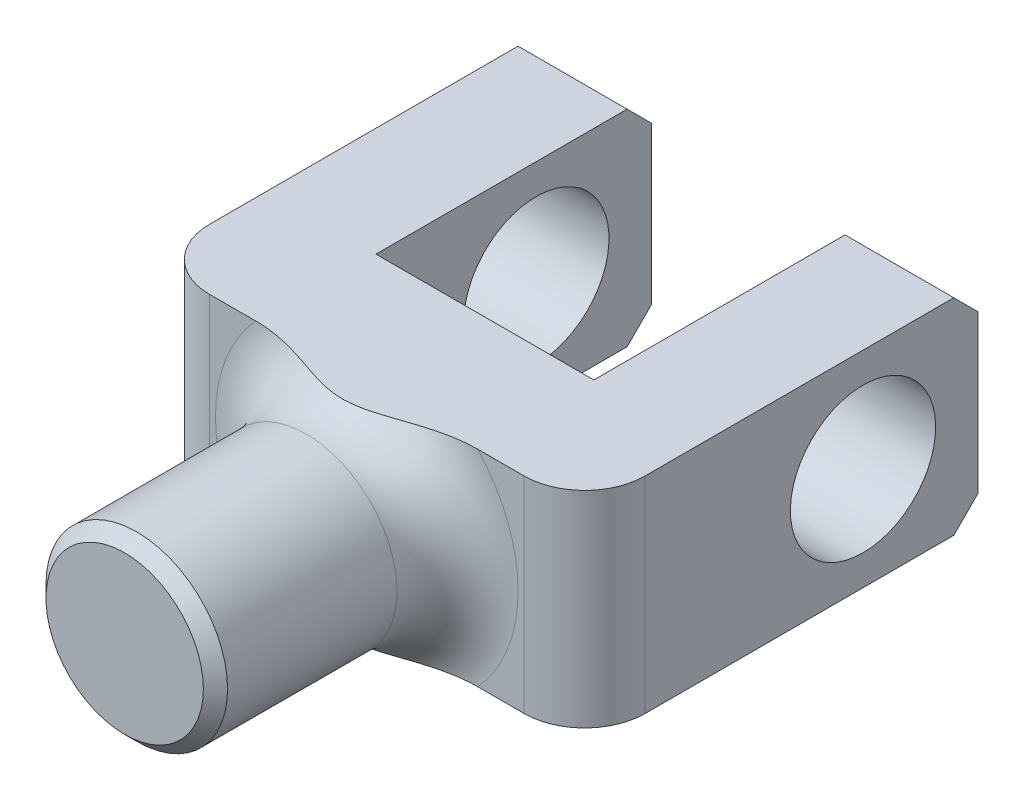
ISO-10303-21;
HEADER;
FILE_DESCRIPTION(('STEP AP214'),'2;1');
FILE_NAME('part.step','',(''),(''),'','','');
FILE_SCHEMA(('AUTOMOTIVE_DESIGN { 1 0 10303 214 1 1 1 1 }'));
ENDSEC;
DATA;
#1=APPLICATION_CONTEXT('core data for automotive mechanical design processes');
#2=APPLICATION_PROTOCOL_DEFINITION('international standard','automotive_design',2000,#1);
#3=PRODUCT_CONTEXT('',#1,'mechanical');
#4=PRODUCT('Part','Part','',(#3));
#5=PRODUCT_RELATED_PRODUCT_CATEGORY('part','',(#4));
#6=PRODUCT_DEFINITION_FORMATION('','',#4);
#7=PRODUCT_DEFINITION_CONTEXT('part definition',#1,'design');
#8=PRODUCT_DEFINITION('design','',#6,#7);
#9=PRODUCT_DEFINITION_SHAPE('','',#8);
#10=(LENGTH_UNIT() NAMED_UNIT(*) SI_UNIT(.MILLI.,.METRE.));
#11=(NAMED_UNIT(*) PLANE_ANGLE_UNIT() SI_UNIT($,.RADIAN.));
#12=(NAMED_UNIT(*) SI_UNIT($,.STERADIAN.) SOLID_ANGLE_UNIT());
#13=UNCERTAINTY_MEASURE_WITH_UNIT(LENGTH_MEASURE(1.E-05),#10,'distance_accuracy_value','');
#14=(GEOMETRIC_REPRESENTATION_CONTEXT(3) GLOBAL_UNCERTAINTY_ASSIGNED_CONTEXT((#13)) GLOBAL_UNIT_ASSIGNED_CONTEXT((#10,
#11,#12)) REPRESENTATION_CONTEXT('',''));
#15=CARTESIAN_POINT('',(0.,0.,0.));
#16=DIRECTION('',(0.,0.,1.));
#17=DIRECTION('',(1.,0.,0.));
#18=AXIS2_PLACEMENT_3D('',#15,#16,#17);
#19=CARTESIAN_POINT('',(17.2291220556745,40.3158458244111,55.));
#20=DIRECTION('',(0.,-1.,0.));
#21=DIRECTION('',(1.,0.,0.));
#22=AXIS2_PLACEMENT_3D('',#19,#20,#21);
#23=CYLINDRICAL_SURFACE('',#22,10.);
#24=DIRECTION('',(0.,-1.,0.));
#25=VECTOR('',#24,1.);
#26=CARTESIAN_POINT('',(27.2291220556745,40.3158458244111,55.));
#27=LINE('',#26,#25);
#28=CARTESIAN_POINT('',(27.2291220556745,40.3158458244111,55.));
#29=VERTEX_POINT('',#28);
#30=CARTESIAN_POINT('',(27.2291220556745,6.31584582441112,55.));
#31=VERTEX_POINT('',#30);
#32=EDGE_CURVE('E432',#29,#31,#27,.T.);
#33=ORIENTED_EDGE('',*,*,#32,.F.);
#34=CARTESIAN_POINT('',(17.2291220556745,40.3158458244111,55.));
#35=DIRECTION('',(0.,-1.,0.));
#36=DIRECTION('',(0.,0.,-1.));
#37=AXIS2_PLACEMENT_3D('',#34,#35,#36);
#38=CIRCLE('',#37,10.);
#39=CARTESIAN_POINT('',(17.2291220556745,40.3158458244111,65.));
#40=VERTEX_POINT('',#39);
#41=EDGE_CURVE('E529',#40,#29,#38,.F.);
#42=ORIENTED_EDGE('',*,*,#41,.F.);
#43=DIRECTION('',(0.,-1.,0.));
#44=VECTOR('',#43,1.);
#45=CARTESIAN_POINT('',(17.2291220556745,0.,65.));
#46=LINE('',#45,#44);
#47=CARTESIAN_POINT('',(17.2291220556745,6.31584582441112,65.));
#48=VERTEX_POINT('',#47);
#49=EDGE_CURVE('E504',#48,#40,#46,.F.);
#50=ORIENTED_EDGE('',*,*,#49,.F.);
#51=CARTESIAN_POINT('',(17.2291220556745,6.31584582441112,55.));
#52=DIRECTION('',(0.,1.,0.));
#53=DIRECTION('',(-1.,0.,0.));
#54=AXIS2_PLACEMENT_3D('',#51,#52,#53);
#55=CIRCLE('',#54,10.);
#56=EDGE_CURVE('E435',#31,#48,#55,.F.);
#57=ORIENTED_EDGE('',*,*,#56,.F.);
#58=EDGE_LOOP('',(#33,#42,#50,#57));
#59=FACE_BOUND('',#58,.T.);
#60=ADVANCED_FACE('F84',(#59),#23,.T.);
#61=CARTESIAN_POINT('',(-34.7708779443255,6.31584582441111,55.));
#62=DIRECTION('',(0.,1.,0.));
#63=DIRECTION('',(0.,0.,1.));
#64=AXIS2_PLACEMENT_3D('',#61,#62,#63);
#65=CYLINDRICAL_SURFACE('',#64,10.);
#66=DIRECTION('',(0.,1.,0.));
#67=VECTOR('',#66,1.);
#68=CARTESIAN_POINT('',(-44.7708779443255,6.31584582441111,55.));
#69=LINE('',#68,#67);
#70=CARTESIAN_POINT('',(-44.7708779443255,6.31584582441111,55.));
#71=VERTEX_POINT('',#70);
#72=CARTESIAN_POINT('',(-44.7708779443255,40.3158458244111,55.));
#73=VERTEX_POINT('',#72);
#74=EDGE_CURVE('E509',#71,#73,#69,.T.);
#75=ORIENTED_EDGE('',*,*,#74,.F.);
#76=CARTESIAN_POINT('',(-34.7708779443255,6.31584582441111,55.));
#77=DIRECTION('',(0.,1.,0.));
#78=DIRECTION('',(-1.,0.,0.));
#79=AXIS2_PLACEMENT_3D('',#76,#77,#78);
#80=CIRCLE('',#79,10.);
#81=CARTESIAN_POINT('',(-34.7708779443255,6.31584582441111,65.));
#82=VERTEX_POINT('',#81);
#83=EDGE_CURVE('E517',#82,#71,#80,.F.);
#84=ORIENTED_EDGE('',*,*,#83,.F.);
#85=DIRECTION('',(0.,1.,0.));
#86=VECTOR('',#85,1.);
#87=CARTESIAN_POINT('',(-34.7708779443255,0.,65.));
#88=LINE('',#87,#86);
#89=CARTESIAN_POINT('',(-34.7708779443255,40.3158458244111,65.));
#90=VERTEX_POINT('',#89);
#91=EDGE_CURVE('E490',#90,#82,#88,.F.);
#92=ORIENTED_EDGE('',*,*,#91,.F.);
#93=CARTESIAN_POINT('',(-34.7708779443255,40.3158458244111,55.));
#94=DIRECTION('',(0.,-1.,0.));
#95=DIRECTION('',(0.,0.,-1.));
#96=AXIS2_PLACEMENT_3D('',#93,#94,#95);
#97=CIRCLE('',#96,10.);
#98=EDGE_CURVE('E522',#73,#90,#97,.F.);
#99=ORIENTED_EDGE('',*,*,#98,.F.);
#100=EDGE_LOOP('',(#75,#84,#92,#99));
#101=FACE_BOUND('',#100,.T.);
#102=ADVANCED_FACE('F315',(#101),#65,.T.);
#103=CARTESIAN_POINT('',(-8.77087794432547,23.3158458244111,75.));
#104=DIRECTION('',(0.,0.,-1.));
#105=DIRECTION('',(-1.,0.,0.));
#106=AXIS2_PLACEMENT_3D('',#103,#104,#105);
#107=TOROIDAL_SURFACE('',#106,25.,10.);
#108=CARTESIAN_POINT('',(-8.77087794432547,23.3158458244111,75.));
#109=DIRECTION('',(0.,0.,-1.));
#110=DIRECTION('',(-1.,0.,0.));
#111=AXIS2_PLACEMENT_3D('',#108,#109,#110);
#112=CIRCLE('',#111,15.);
#113=CARTESIAN_POINT('',(-23.7708779443255,23.3158458244111,75.));
#114=VERTEX_POINT('',#113);
#115=EDGE_CURVE('E271',#114,#114,#112,.F.);
#116=ORIENTED_EDGE('',*,*,#115,.F.);
#117=EDGE_LOOP('',(#116));
#118=FACE_BOUND('',#117,.T.);
#119=CARTESIAN_POINT('',(-27.1011807241488,40.3158458244111,65.));
#120=CARTESIAN_POINT('',(-26.7822287961629,40.3158458244111,64.9999999765905));
#121=CARTESIAN_POINT('',(-26.4633667016794,40.3158458244111,65.0082034472168));
#122=CARTESIAN_POINT('',(-25.8265308566789,40.3158458244111,65.0397990120687));
#123=CARTESIAN_POINT('',(-25.5085567700214,40.3158458244111,65.0631842455926));
#124=CARTESIAN_POINT('',(-24.5575387074593,40.3158458244111,65.1542084302681));
#125=CARTESIAN_POINT('',(-23.9264488646185,40.3158458244111,65.2427231329521));
#126=CARTESIAN_POINT('',(-22.6558912875072,40.3158458244111,65.4684215154835));
#127=CARTESIAN_POINT('',(-22.0166535454229,40.3158458244111,65.6068480964166));
#128=CARTESIAN_POINT('',(-20.7478282199285,40.3158458244111,65.920583970391));
#129=CARTESIAN_POINT('',(-20.1182360830403,40.3158458244111,66.0958752463392));
#130=CARTESIAN_POINT('',(-19.0037420474493,40.3158458244111,66.4301776550955));
#131=CARTESIAN_POINT('',(-18.5173499328625,40.3158458244111,66.5843464969013));
#132=CARTESIAN_POINT('',(-17.5474011933552,40.3158458244111,66.9013666284473));
#133=CARTESIAN_POINT('',(-17.0638447522287,40.3158458244111,67.0642184742207));
#134=CARTESIAN_POINT('',(-16.3378745445991,40.3158458244111,67.3095309996821));
#135=CARTESIAN_POINT('',(-16.0953320539569,40.3158458244111,67.3916261892551));
#136=CARTESIAN_POINT('',(-15.6099405230153,40.3158458244111,67.5549028881324));
#137=CARTESIAN_POINT('',(-15.3670914849674,40.3158458244111,67.6360844041048));
#138=CARTESIAN_POINT('',(-14.8806067047279,40.3158458244111,67.7962803323809));
#139=CARTESIAN_POINT('',(-14.636970790428,40.3158458244111,67.8752942288198));
#140=CARTESIAN_POINT('',(-14.1485477742455,40.3158458244111,68.0296679522297));
#141=CARTESIAN_POINT('',(-13.9037606414176,40.3158458244111,68.1050276803521));
#142=CARTESIAN_POINT('',(-13.1852370481622,40.3158458244111,68.3178031351));
#143=CARTESIAN_POINT('',(-12.7092781897232,40.3158458244111,68.4481030803418));
#144=CARTESIAN_POINT('',(-11.9894462032609,40.3158458244111,68.6186374019243));
#145=CARTESIAN_POINT('',(-11.7485399169853,40.3158458244111,68.6713262777047));
#146=CARTESIAN_POINT('',(-11.2647447923755,40.3158458244111,68.7665526365442));
#147=CARTESIAN_POINT('',(-11.0218563069375,40.3158458244111,68.8090918874809));
#148=CARTESIAN_POINT('',(-10.5363371576699,40.3158458244111,68.8819996020455));
#149=CARTESIAN_POINT('',(-10.2937216955109,40.3158458244111,68.9124679827324));
#150=CARTESIAN_POINT('',(-9.80719160021027,40.3158458244111,68.9603553349178));
#151=CARTESIAN_POINT('',(-9.56327699745105,40.3158458244111,68.977774610253));
#152=CARTESIAN_POINT('',(-9.07492989013347,40.3158458244111,68.9986949593541));
#153=CARTESIAN_POINT('',(-8.83049759918579,40.3158458244111,69.0022009520805));
#154=CARTESIAN_POINT('',(-8.34184425846334,40.3158458244111,68.9951237729492));
#155=CARTESIAN_POINT('',(-8.09762320109899,40.3158458244111,68.9845411302914));
#156=CARTESIAN_POINT('',(-7.66812849755424,40.3158458244111,68.9539647377072));
#157=CARTESIAN_POINT('',(-7.48264549742014,40.3158458244111,68.9368068607216));
#158=CARTESIAN_POINT('',(-7.11250328185269,40.3158458244111,68.8951204203172));
#159=CARTESIAN_POINT('',(-6.92784412940252,40.3158458244111,68.8705913028439));
#160=CARTESIAN_POINT('',(-6.37538185946503,40.3158458244111,68.7868680805503));
#161=CARTESIAN_POINT('',(-6.00909983752891,40.3158458244111,68.7175385626282));
#162=CARTESIAN_POINT('',(-5.27880213078365,40.3158458244111,68.5574228912256));
#163=CARTESIAN_POINT('',(-4.91481903859819,40.3158458244111,68.4664933472288));
#164=CARTESIAN_POINT('',(-4.19098366700157,40.3158458244111,68.2697732936779));
#165=CARTESIAN_POINT('',(-3.83113120095126,40.3158458244111,68.1639834584566));
#166=CARTESIAN_POINT('',(-3.1005146799794,40.3158458244111,67.9388662388692));
#167=CARTESIAN_POINT('',(-2.72986499800355,40.3158458244111,67.8191741207872));
#168=CARTESIAN_POINT('',(-1.99016692628789,40.3158458244111,67.5750191991421));
#169=CARTESIAN_POINT('',(-1.6211185203701,40.3158458244111,67.4505564439033));
#170=CARTESIAN_POINT('',(-0.884084185797127,40.3158458244111,67.2014846963883));
#171=CARTESIAN_POINT('',(-0.51609787711605,40.3158458244111,67.0768768173913));
#172=CARTESIAN_POINT('',(0.220934020641621,40.3158458244111,66.8308158211743));
#173=CARTESIAN_POINT('',(0.589979597313518,40.3158458244111,66.7093626671765));
#174=CARTESIAN_POINT('',(1.32478072251782,40.3158458244111,66.4744265591823));
#175=CARTESIAN_POINT('',(1.69050743834978,40.3158458244111,66.3608542121729));
#176=CARTESIAN_POINT('',(2.42458609011452,40.3158458244111,66.1424755010138));
#177=CARTESIAN_POINT('',(2.7929379980023,40.3158458244111,66.03766904337));
#178=CARTESIAN_POINT('',(3.53255947272921,40.3158458244111,65.8393205259961));
#179=CARTESIAN_POINT('',(3.9038280591552,40.3158458244111,65.7457748402921));
#180=CARTESIAN_POINT('',(4.64951525500419,40.3158458244111,65.5722507206898));
#181=CARTESIAN_POINT('',(5.02393357696605,40.3158458244111,65.4922710624875));
#182=CARTESIAN_POINT('',(5.76633613682528,40.3158458244111,65.3499422570415));
#183=CARTESIAN_POINT('',(6.13424409400565,40.3158458244111,65.2871989028186));
#184=CARTESIAN_POINT('',(6.87252086897315,40.3158458244111,65.1787826179311));
#185=CARTESIAN_POINT('',(7.24288920139515,40.3158458244111,65.1331064165304));
#186=CARTESIAN_POINT('',(7.98703655630066,40.3158458244111,65.0606675596706));
#187=CARTESIAN_POINT('',(8.36082332126401,40.3158458244111,65.0339824500208));
#188=CARTESIAN_POINT('',(9.10956437163241,40.3158458244111,65.0017978339897));
#189=CARTESIAN_POINT('',(9.48451931250049,40.3158458244111,64.9963138882017));
#190=CARTESIAN_POINT('',(9.85940741253844,40.3158458244111,65.0024373949675));
#191=B_SPLINE_CURVE_WITH_KNOTS('',3,(#119,#120,#121,#122,#123,#124,#125,#126,#127,#128,#129,
#130,#131,#132,#133,#134,#135,#136,#137,#138,#139,#140,#141,#142,#143,#144,#145,#146,#147,#148,
#149,#150,#151,#152,#153,#154,#155,#156,#157,#158,#159,#160,#161,#162,#163,#164,#165,#166,#167,
#168,#169,#170,#171,#172,#173,#174,#175,#176,#177,#178,#179,#180,#181,#182,#183,#184,#185,#186,
#187,#188,#189,#190),.UNSPECIFIED.,.F.,.F.,(4,2,2,2,2,2,2,2,2,2,2,2,2,2,2,2,2,2,2,2,2,2,2,2,2,2,
2,2,2,2,2,2,2,2,2,4),(0.,0.956605090842401,1.9127781885001,3.82228496738571,5.78305988530367,
7.74287872030254,9.27348111542979,10.804181643685,11.5723617102261,12.3405361667395,
13.1088918800318,13.8772683665142,15.3567694921308,16.0963987871005,16.8358991580744,
17.5691435625241,18.3023708935107,19.0353389731186,19.7682795216223,20.3269534247612,
20.8856693307733,22.0031188727751,23.1282047273474,24.2532395440749,25.4216602912566,
26.5900692060591,27.7556033156376,28.9211238313138,30.0699111783337,31.2186862711699,
32.3670904627329,33.5153909581393,34.6346944489816,35.7537833272141,36.8774159328818,
38.0018730722687),.UNSPECIFIED.);
#192=CARTESIAN_POINT('',(-27.1011807241488,40.3158458244111,65.));
#193=VERTEX_POINT('',#192);
#194=CARTESIAN_POINT('',(9.55942483549789,40.3158458244111,65.));
#195=VERTEX_POINT('',#194);
#196=EDGE_CURVE('E299',#193,#195,#191,.T.);
#197=ORIENTED_EDGE('',*,*,#196,.F.);
#198=CARTESIAN_POINT('',(-8.77087794432547,23.3158458244111,65.));
#199=DIRECTION('',(0.,0.,-1.));
#200=DIRECTION('',(-1.,0.,0.));
#201=AXIS2_PLACEMENT_3D('',#198,#199,#200);
#202=CIRCLE('',#201,25.);
#203=CARTESIAN_POINT('',(-27.1011807241488,6.31584582441111,65.));
#204=VERTEX_POINT('',#203);
#205=EDGE_CURVE('E285',#204,#193,#202,.T.);
#206=ORIENTED_EDGE('',*,*,#205,.F.);
#207=CARTESIAN_POINT('',(9.55942483549789,6.31584582441111,65.));
#208=CARTESIAN_POINT('',(9.24047290751195,6.31584582441111,64.9999999765905));
#209=CARTESIAN_POINT('',(8.92161081302844,6.31584582441111,65.0082034472168));
#210=CARTESIAN_POINT('',(8.28477496802793,6.31584582441111,65.0397990120687));
#211=CARTESIAN_POINT('',(7.96680088137042,6.31584582441111,65.0631842455926));
#212=CARTESIAN_POINT('',(7.01578281880838,6.31584582441111,65.1542084302681));
#213=CARTESIAN_POINT('',(6.38469297596753,6.31584582441111,65.2427231329521));
#214=CARTESIAN_POINT('',(5.11413539885623,6.31584582441111,65.4684215154835));
#215=CARTESIAN_POINT('',(4.47489765677197,6.31584582441111,65.6068480964166));
#216=CARTESIAN_POINT('',(3.20607233127749,6.31584582441111,65.920583970391));
#217=CARTESIAN_POINT('',(2.57648019438931,6.31584582441111,66.0958752463392));
#218=CARTESIAN_POINT('',(1.46198615879832,6.31584582441111,66.4301776550955));
#219=CARTESIAN_POINT('',(0.975594044211556,6.31584582441111,66.5843464969013));
#220=CARTESIAN_POINT('',(0.00564530470417913,6.31584582441111,66.9013666284473));
#221=CARTESIAN_POINT('',(-0.477911136422321,6.31584582441111,67.0642184742208));
#222=CARTESIAN_POINT('',(-1.20388134405188,6.31584582441111,67.3095309996821));
#223=CARTESIAN_POINT('',(-1.44642383469406,6.31584582441111,67.3916261892552));
#224=CARTESIAN_POINT('',(-1.93181536563572,6.31584582441111,67.5549028881324));
#225=CARTESIAN_POINT('',(-2.17466440368353,6.31584582441111,67.6360844041048));
#226=CARTESIAN_POINT('',(-2.6611491839231,6.31584582441111,67.796280332381));
#227=CARTESIAN_POINT('',(-2.90478509822298,6.31584582441111,67.8752942288198));
#228=CARTESIAN_POINT('',(-3.39320811440547,6.31584582441111,68.0296679522298));
#229=CARTESIAN_POINT('',(-3.63799524723338,6.31584582441111,68.1050276803521));
#230=CARTESIAN_POINT('',(-4.3565188404888,6.31584582441111,68.3178031351));
#231=CARTESIAN_POINT('',(-4.8324776989278,6.31584582441111,68.4481030803418));
#232=CARTESIAN_POINT('',(-5.55230968539006,6.31584582441111,68.6186374019243));
#233=CARTESIAN_POINT('',(-5.79321597166568,6.31584582441111,68.6713262777047));
#234=CARTESIAN_POINT('',(-6.27701109627549,6.31584582441111,68.7665526365442));
#235=CARTESIAN_POINT('',(-6.51989958171353,6.31584582441111,68.8090918874809));
#236=CARTESIAN_POINT('',(-7.00541873098107,6.31584582441111,68.8819996020455));
#237=CARTESIAN_POINT('',(-7.24803419314004,6.31584582441111,68.9124679827324));
#238=CARTESIAN_POINT('',(-7.73456428844072,6.31584582441111,68.9603553349178));
#239=CARTESIAN_POINT('',(-7.97847889119994,6.31584582441111,68.977774610253));
#240=CARTESIAN_POINT('',(-8.46682599851751,6.31584582441111,68.9986949593541));
#241=CARTESIAN_POINT('',(-8.7112582894652,6.31584582441111,69.0022009520805));
#242=CARTESIAN_POINT('',(-9.19991163018764,6.31584582441111,68.9951237729492));
#243=CARTESIAN_POINT('',(-9.444132687552,6.31584582441111,68.9845411302914));
#244=CARTESIAN_POINT('',(-9.87362739109675,6.31584582441111,68.9539647377072));
#245=CARTESIAN_POINT('',(-10.0591103912308,6.31584582441111,68.9368068607216));
#246=CARTESIAN_POINT('',(-10.4292526067983,6.31584582441111,68.8951204203172));
#247=CARTESIAN_POINT('',(-10.6139117592485,6.31584582441111,68.8705913028439));
#248=CARTESIAN_POINT('',(-11.166374029186,6.31584582441111,68.7868680805503));
#249=CARTESIAN_POINT('',(-11.5326560511221,6.31584582441111,68.7175385626282));
#250=CARTESIAN_POINT('',(-12.2629537578674,6.31584582441111,68.5574228912256));
#251=CARTESIAN_POINT('',(-12.6269368500528,6.31584582441111,68.4664933472287));
#252=CARTESIAN_POINT('',(-13.3507722216494,6.31584582441111,68.2697732936779));
#253=CARTESIAN_POINT('',(-13.7106246876998,6.31584582441111,68.1639834584566));
#254=CARTESIAN_POINT('',(-14.4412412086716,6.31584582441111,67.9388662388692));
#255=CARTESIAN_POINT('',(-14.8118908906475,6.31584582441111,67.8191741207871));
#256=CARTESIAN_POINT('',(-15.5515889623631,6.31584582441111,67.5750191991421));
#257=CARTESIAN_POINT('',(-15.9206373682809,6.31584582441111,67.4505564439032));
#258=CARTESIAN_POINT('',(-16.6576717028539,6.31584582441111,67.2014846963882));
#259=CARTESIAN_POINT('',(-17.025658011535,6.31584582441111,67.0768768173912));
#260=CARTESIAN_POINT('',(-17.7626899092927,6.31584582441111,66.8308158211742));
#261=CARTESIAN_POINT('',(-18.1317354859646,6.31584582441111,66.7093626671764));
#262=CARTESIAN_POINT('',(-18.8665366111689,6.31584582441111,66.4744265591823));
#263=CARTESIAN_POINT('',(-19.2322633270008,6.31584582441111,66.3608542121728));
#264=CARTESIAN_POINT('',(-19.9663419787656,6.31584582441111,66.1424755010138));
#265=CARTESIAN_POINT('',(-20.3346938866534,6.31584582441111,66.0376690433699));
#266=CARTESIAN_POINT('',(-21.0743153613803,6.31584582441111,65.8393205259961));
#267=CARTESIAN_POINT('',(-21.4455839478063,6.31584582441111,65.745774840292));
#268=CARTESIAN_POINT('',(-22.1912711436553,6.31584582441111,65.5722507206897));
#269=CARTESIAN_POINT('',(-22.5656894656171,6.31584582441111,65.4922710624874));
#270=CARTESIAN_POINT('',(-23.3080920254764,6.31584582441111,65.3499422570415));
#271=CARTESIAN_POINT('',(-23.6759999826567,6.31584582441111,65.2871989028185));
#272=CARTESIAN_POINT('',(-24.4142767576242,6.31584582441111,65.178782617931));
#273=CARTESIAN_POINT('',(-24.7846450900463,6.31584582441111,65.1331064165304));
#274=CARTESIAN_POINT('',(-25.5287924449518,6.31584582441111,65.0606675596706));
#275=CARTESIAN_POINT('',(-25.9025792099151,6.31584582441111,65.0339824500208));
#276=CARTESIAN_POINT('',(-26.6513202602835,6.31584582441111,65.0017978339897));
#277=CARTESIAN_POINT('',(-27.0262752011516,6.31584582441111,64.9963138882017));
#278=CARTESIAN_POINT('',(-27.4011633011896,6.31584582441111,65.0024373949675));
#279=B_SPLINE_CURVE_WITH_KNOTS('',3,(#207,#208,#209,#210,#211,#212,#213,#214,#215,#216,#217,
#218,#219,#220,#221,#222,#223,#224,#225,#226,#227,#228,#229,#230,#231,#232,#233,#234,#235,#236,
#237,#238,#239,#240,#241,#242,#243,#244,#245,#246,#247,#248,#249,#250,#251,#252,#253,#254,#255,
#256,#257,#258,#259,#260,#261,#262,#263,#264,#265,#266,#267,#268,#269,#270,#271,#272,#273,#274,
#275,#276,#277,#278),.UNSPECIFIED.,.F.,.F.,(4,2,2,2,2,2,2,2,2,2,2,2,2,2,2,2,2,2,2,2,2,2,2,2,2,2,
2,2,2,2,2,2,2,2,2,4),(0.,0.956605090842407,1.91277818850011,3.82228496738572,5.78305988530369,
7.74287872030257,9.27348111542982,10.8041816436851,11.5723617102261,12.3405361667395,
13.1088918800318,13.8772683665142,15.3567694921308,16.0963987871006,16.8358991580744,
17.5691435625241,18.3023708935108,19.0353389731186,19.7682795216224,20.3269534247613,
20.8856693307734,22.0031188727752,23.1282047273475,24.253239544075,25.4216602912567,
26.5900692060592,27.7556033156376,28.9211238313139,30.0699111783338,31.21868627117,
32.367090462733,33.5153909581395,34.6346944489818,35.7537833272143,36.877415932882,
38.0018730722689),.UNSPECIFIED.);
#280=CARTESIAN_POINT('',(9.55942483549789,6.31584582441112,65.));
#281=VERTEX_POINT('',#280);
#282=EDGE_CURVE('E289',#281,#204,#279,.T.);
#283=ORIENTED_EDGE('',*,*,#282,.F.);
#284=CARTESIAN_POINT('',(-8.77087794432547,23.3158458244111,65.));
#285=DIRECTION('',(0.,0.,-1.));
#286=DIRECTION('',(-1.,0.,0.));
#287=AXIS2_PLACEMENT_3D('',#284,#285,#286);
#288=CIRCLE('',#287,25.);
#289=EDGE_CURVE('E281',#195,#281,#288,.T.);
#290=ORIENTED_EDGE('',*,*,#289,.F.);
#291=EDGE_LOOP('',(#197,#206,#283,#290));
#292=FACE_BOUND('',#291,.T.);
#293=ADVANCED_FACE('F310',(#118,#292),#107,.F.);
#294=CARTESIAN_POINT('',(0.,0.,65.));
#295=DIRECTION('',(0.,0.,-1.));
#296=DIRECTION('',(-1.,0.,0.));
#297=AXIS2_PLACEMENT_3D('',#294,#295,#296);
#298=PLANE('',#297);
#299=DIRECTION('',(-1.,0.,0.));
#300=VECTOR('',#299,1.);
#301=CARTESIAN_POINT('',(-44.7708779443255,40.3158458244111,65.));
#302=LINE('',#301,#300);
#303=EDGE_CURVE('E244',#193,#90,#302,.T.);
#304=ORIENTED_EDGE('',*,*,#303,.T.);
#305=ORIENTED_EDGE('',*,*,#91,.T.);
#306=DIRECTION('',(1.,0.,0.));
#307=VECTOR('',#306,1.);
#308=CARTESIAN_POINT('',(27.2291220556745,6.31584582441112,65.));
#309=LINE('',#308,#307);
#310=EDGE_CURVE('E241',#82,#204,#309,.T.);
#311=ORIENTED_EDGE('',*,*,#310,.T.);
#312=ORIENTED_EDGE('',*,*,#205,.T.);
#313=EDGE_LOOP('',(#304,#305,#311,#312));
#314=FACE_BOUND('',#313,.T.);
#315=ADVANCED_FACE('F314',(#314),#298,.F.);
#316=CARTESIAN_POINT('',(0.,0.,0.));
#317=DIRECTION('',(0.,0.,-1.));
#318=DIRECTION('',(-1.,0.,0.));
#319=AXIS2_PLACEMENT_3D('',#316,#317,#318);
#320=PLANE('',#319);
#321=DIRECTION('',(0.,1.,0.));
#322=VECTOR('',#321,1.);
#323=CARTESIAN_POINT('',(-26.7445389275703,6.31584582441111,0.));
#324=LINE('',#323,#322);
#325=CARTESIAN_POINT('',(-26.7445389275703,10.3158458244111,0.));
#326=VERTEX_POINT('',#325);
#327=CARTESIAN_POINT('',(-26.7445389275703,36.3158458244111,0.));
#328=VERTEX_POINT('',#327);
#329=EDGE_CURVE('E224',#326,#328,#324,.T.);
#330=ORIENTED_EDGE('',*,*,#329,.F.);
#331=DIRECTION('',(-1.,0.,0.));
#332=VECTOR('',#331,1.);
#333=CARTESIAN_POINT('',(-44.7708779443255,10.3158458244111,0.));
#334=LINE('',#333,#332);
#335=CARTESIAN_POINT('',(-44.7708779443255,10.3158458244111,0.));
#336=VERTEX_POINT('',#335);
#337=EDGE_CURVE('E109',#326,#336,#334,.T.);
#338=ORIENTED_EDGE('',*,*,#337,.T.);
#339=DIRECTION('',(0.,-1.,0.));
#340=VECTOR('',#339,1.);
#341=CARTESIAN_POINT('',(-44.7708779443255,6.31584582441111,0.));
#342=LINE('',#341,#340);
#343=CARTESIAN_POINT('',(-44.7708779443255,36.3158458244111,0.));
#344=VERTEX_POINT('',#343);
#345=EDGE_CURVE('E250',#344,#336,#342,.T.);
#346=ORIENTED_EDGE('',*,*,#345,.F.);
#347=DIRECTION('',(1.,0.,0.));
#348=VECTOR('',#347,1.);
#349=CARTESIAN_POINT('',(-26.7445389275703,36.3158458244111,0.));
#350=LINE('',#349,#348);
#351=EDGE_CURVE('E358',#344,#328,#350,.T.);
#352=ORIENTED_EDGE('',*,*,#351,.T.);
#353=EDGE_LOOP('',(#330,#338,#346,#352));
#354=FACE_BOUND('',#353,.T.);
#355=ADVANCED_FACE('F412',(#354),#320,.T.);
#356=CARTESIAN_POINT('',(-44.7708779443255,6.31584582441111,65.));
#357=DIRECTION('',(1.,0.,0.));
#358=DIRECTION('',(0.,0.,-1.));
#359=AXIS2_PLACEMENT_3D('',#356,#357,#358);
#360=PLANE('',#359);
#361=CARTESIAN_POINT('',(-44.7708779443255,23.3158458244111,19.));
#362=DIRECTION('',(-1.,0.,0.));
#363=DIRECTION('',(0.,0.,1.));
#364=AXIS2_PLACEMENT_3D('',#361,#362,#363);
#365=CIRCLE('',#364,12.);
#366=CARTESIAN_POINT('',(-44.7708779443255,23.3158458244111,31.));
#367=VERTEX_POINT('',#366);
#368=EDGE_CURVE('E277',#367,#367,#365,.T.);
#369=ORIENTED_EDGE('',*,*,#368,.F.);
#370=EDGE_LOOP('',(#369));
#371=FACE_BOUND('',#370,.T.);
#372=ORIENTED_EDGE('',*,*,#345,.T.);
#373=DIRECTION('',(0.,-0.707106781186549,0.707106781186546));
#374=VECTOR('',#373,1.);
#375=CARTESIAN_POINT('',(-44.7708779443255,6.31584582441111,3.99999999999999));
#376=LINE('',#375,#374);
#377=CARTESIAN_POINT('',(-44.7708779443255,6.31584582441111,3.99999999999999));
#378=VERTEX_POINT('',#377);
#379=EDGE_CURVE('E380',#336,#378,#376,.T.);
#380=ORIENTED_EDGE('',*,*,#379,.T.);
#381=DIRECTION('',(0.,0.,-1.));
#382=VECTOR('',#381,1.);
#383=CARTESIAN_POINT('',(-44.7708779443255,6.31584582441111,65.));
#384=LINE('',#383,#382);
#385=EDGE_CURVE('E267',#71,#378,#384,.T.);
#386=ORIENTED_EDGE('',*,*,#385,.F.);
#387=ORIENTED_EDGE('',*,*,#74,.T.);
#388=DIRECTION('',(0.,0.,-1.));
#389=VECTOR('',#388,1.);
#390=CARTESIAN_POINT('',(-44.7708779443255,40.3158458244111,65.));
#391=LINE('',#390,#389);
#392=CARTESIAN_POINT('',(-44.7708779443255,40.3158458244111,3.99999999999998));
#393=VERTEX_POINT('',#392);
#394=EDGE_CURVE('E249',#73,#393,#391,.T.);
#395=ORIENTED_EDGE('',*,*,#394,.T.);
#396=DIRECTION('',(0.,-0.707106781186549,-0.707106781186546));
#397=VECTOR('',#396,1.);
#398=CARTESIAN_POINT('',(-44.7708779443255,40.3158458244111,3.99999999999998));
#399=LINE('',#398,#397);
#400=EDGE_CURVE('E101',#393,#344,#399,.T.);
#401=ORIENTED_EDGE('',*,*,#400,.T.);
#402=EDGE_LOOP('',(#372,#380,#386,#387,#395,#401));
#403=FACE_BOUND('',#402,.T.);
#404=ADVANCED_FACE('F317',(#371,#403),#360,.F.);
#405=CARTESIAN_POINT('',(27.2291220556745,6.31584582441112,65.));
#406=DIRECTION('',(0.,1.,0.));
#407=DIRECTION('',(-1.,0.,0.));
#408=AXIS2_PLACEMENT_3D('',#405,#406,#407);
#409=PLANE('',#408);
#410=DIRECTION('',(0.,0.,-1.));
#411=VECTOR('',#410,1.);
#412=CARTESIAN_POINT('',(9.25546107242969,6.31584582441112,45.5));
#413=LINE('',#412,#411);
#414=CARTESIAN_POINT('',(9.25546107242969,6.31584582441112,45.5));
#415=VERTEX_POINT('',#414);
#416=CARTESIAN_POINT('',(9.25546107242969,6.31584582441112,3.99999999999998));
#417=VERTEX_POINT('',#416);
#418=EDGE_CURVE('E209',#415,#417,#413,.T.);
#419=ORIENTED_EDGE('',*,*,#418,.T.);
#420=DIRECTION('',(1.,0.,0.));
#421=VECTOR('',#420,1.);
#422=CARTESIAN_POINT('',(27.2291220556745,6.31584582441112,3.99999999999998));
#423=LINE('',#422,#421);
#424=CARTESIAN_POINT('',(27.2291220556745,6.31584582441112,3.99999999999998));
#425=VERTEX_POINT('',#424);
#426=EDGE_CURVE('E438',#417,#425,#423,.T.);
#427=ORIENTED_EDGE('',*,*,#426,.T.);
#428=DIRECTION('',(0.,0.,-1.));
#429=VECTOR('',#428,1.);
#430=CARTESIAN_POINT('',(27.2291220556745,6.31584582441112,65.));
#431=LINE('',#430,#429);
#432=EDGE_CURVE('E263',#31,#425,#431,.T.);
#433=ORIENTED_EDGE('',*,*,#432,.F.);
#434=ORIENTED_EDGE('',*,*,#56,.T.);
#435=EDGE_CURVE('E245',#281,#48,#309,.T.);
#436=ORIENTED_EDGE('',*,*,#435,.F.);
#437=ORIENTED_EDGE('',*,*,#282,.T.);
#438=ORIENTED_EDGE('',*,*,#310,.F.);
#439=ORIENTED_EDGE('',*,*,#83,.T.);
#440=ORIENTED_EDGE('',*,*,#385,.T.);
#441=DIRECTION('',(1.,0.,0.));
#442=VECTOR('',#441,1.);
#443=CARTESIAN_POINT('',(-26.7445389275703,6.31584582441111,3.99999999999999));
#444=LINE('',#443,#442);
#445=CARTESIAN_POINT('',(-26.7445389275703,6.31584582441111,3.99999999999999));
#446=VERTEX_POINT('',#445);
#447=EDGE_CURVE('E441',#378,#446,#444,.T.);
#448=ORIENTED_EDGE('',*,*,#447,.T.);
#449=DIRECTION('',(0.,0.,-1.));
#450=VECTOR('',#449,1.);
#451=CARTESIAN_POINT('',(-26.7445389275703,6.31584582441111,45.5));
#452=LINE('',#451,#450);
#453=CARTESIAN_POINT('',(-26.7445389275703,6.31584582441111,45.5));
#454=VERTEX_POINT('',#453);
#455=EDGE_CURVE('E236',#454,#446,#452,.T.);
#456=ORIENTED_EDGE('',*,*,#455,.F.);
#457=DIRECTION('',(-1.,0.,0.));
#458=VECTOR('',#457,1.);
#459=CARTESIAN_POINT('',(9.25546107242969,6.31584582441112,45.5));
#460=LINE('',#459,#458);
#461=EDGE_CURVE('E213',#415,#454,#460,.T.);
#462=ORIENTED_EDGE('',*,*,#461,.F.);
#463=EDGE_LOOP('',(#419,#427,#433,#434,#436,#437,#438,#439,#440,#448,#456,#462));
#464=FACE_BOUND('',#463,.T.);
#465=ADVANCED_FACE('F306',(#464),#409,.F.);
#466=CARTESIAN_POINT('',(27.2291220556745,40.3158458244111,65.));
#467=DIRECTION('',(-1.,0.,0.));
#468=DIRECTION('',(0.,-1.,0.));
#469=AXIS2_PLACEMENT_3D('',#466,#467,#468);
#470=PLANE('',#469);
#471=CARTESIAN_POINT('',(27.2291220556745,23.3158458244111,19.));
#472=DIRECTION('',(-1.,0.,0.));
#473=DIRECTION('',(0.,-1.,0.));
#474=AXIS2_PLACEMENT_3D('',#471,#472,#473);
#475=CIRCLE('',#474,12.);
#476=CARTESIAN_POINT('',(27.2291220556745,11.3158458244111,19.));
#477=VERTEX_POINT('',#476);
#478=EDGE_CURVE('E425',#477,#477,#475,.T.);
#479=ORIENTED_EDGE('',*,*,#478,.T.);
#480=EDGE_LOOP('',(#479));
#481=FACE_BOUND('',#480,.T.);
#482=ORIENTED_EDGE('',*,*,#432,.T.);
#483=DIRECTION('',(0.,0.707106781186549,-0.707106781186546));
#484=VECTOR('',#483,1.);
#485=CARTESIAN_POINT('',(27.2291220556745,6.31584582441112,3.99999999999998));
#486=LINE('',#485,#484);
#487=CARTESIAN_POINT('',(27.2291220556745,10.3158458244111,0.));
#488=VERTEX_POINT('',#487);
#489=EDGE_CURVE('E428',#425,#488,#486,.T.);
#490=ORIENTED_EDGE('',*,*,#489,.T.);
#491=DIRECTION('',(0.,1.,0.));
#492=VECTOR('',#491,1.);
#493=CARTESIAN_POINT('',(27.2291220556745,40.3158458244111,0.));
#494=LINE('',#493,#492);
#495=CARTESIAN_POINT('',(27.2291220556745,36.3158458244111,0.));
#496=VERTEX_POINT('',#495);
#497=EDGE_CURVE('E253',#488,#496,#494,.T.);
#498=ORIENTED_EDGE('',*,*,#497,.T.);
#499=DIRECTION('',(0.,0.707106781186549,0.707106781186546));
#500=VECTOR('',#499,1.);
#501=CARTESIAN_POINT('',(27.2291220556745,40.3158458244111,3.99999999999998));
#502=LINE('',#501,#500);
#503=CARTESIAN_POINT('',(27.2291220556745,40.3158458244111,3.99999999999998));
#504=VERTEX_POINT('',#503);
#505=EDGE_CURVE('E448',#496,#504,#502,.T.);
#506=ORIENTED_EDGE('',*,*,#505,.T.);
#507=DIRECTION('',(0.,0.,-1.));
#508=VECTOR('',#507,1.);
#509=CARTESIAN_POINT('',(27.2291220556745,40.3158458244111,65.));
#510=LINE('',#509,#508);
#511=EDGE_CURVE('E260',#29,#504,#510,.T.);
#512=ORIENTED_EDGE('',*,*,#511,.F.);
#513=ORIENTED_EDGE('',*,*,#32,.T.);
#514=EDGE_LOOP('',(#482,#490,#498,#506,#512,#513));
#515=FACE_BOUND('',#514,.T.);
#516=ADVANCED_FACE('F415',(#481,#515),#470,.F.);
#517=CARTESIAN_POINT('',(-44.7708779443255,40.3158458244111,65.));
#518=DIRECTION('',(0.,-1.,0.));
#519=DIRECTION('',(0.,0.,-1.));
#520=AXIS2_PLACEMENT_3D('',#517,#518,#519);
#521=PLANE('',#520);
#522=DIRECTION('',(0.,0.,-1.));
#523=VECTOR('',#522,1.);
#524=CARTESIAN_POINT('',(-26.7445389275703,40.3158458244111,45.5));
#525=LINE('',#524,#523);
#526=CARTESIAN_POINT('',(-26.7445389275703,40.3158458244111,45.5));
#527=VERTEX_POINT('',#526);
#528=CARTESIAN_POINT('',(-26.7445389275703,40.3158458244111,3.99999999999998));
#529=VERTEX_POINT('',#528);
#530=EDGE_CURVE('E254',#527,#529,#525,.T.);
#531=ORIENTED_EDGE('',*,*,#530,.T.);
#532=DIRECTION('',(-1.,0.,0.));
#533=VECTOR('',#532,1.);
#534=CARTESIAN_POINT('',(-44.7708779443255,40.3158458244111,3.99999999999998));
#535=LINE('',#534,#533);
#536=EDGE_CURVE('E359',#529,#393,#535,.T.);
#537=ORIENTED_EDGE('',*,*,#536,.T.);
#538=ORIENTED_EDGE('',*,*,#394,.F.);
#539=ORIENTED_EDGE('',*,*,#98,.T.);
#540=ORIENTED_EDGE('',*,*,#303,.F.);
#541=ORIENTED_EDGE('',*,*,#196,.T.);
#542=EDGE_CURVE('E246',#40,#195,#302,.T.);
#543=ORIENTED_EDGE('',*,*,#542,.F.);
#544=ORIENTED_EDGE('',*,*,#41,.T.);
#545=ORIENTED_EDGE('',*,*,#511,.T.);
#546=DIRECTION('',(-1.,0.,0.));
#547=VECTOR('',#546,1.);
#548=CARTESIAN_POINT('',(9.25546107242969,40.3158458244111,3.99999999999998));
#549=LINE('',#548,#547);
#550=CARTESIAN_POINT('',(9.25546107242969,40.3158458244111,3.99999999999998));
#551=VERTEX_POINT('',#550);
#552=EDGE_CURVE('E230',#504,#551,#549,.T.);
#553=ORIENTED_EDGE('',*,*,#552,.T.);
#554=DIRECTION('',(0.,0.,-1.));
#555=VECTOR('',#554,1.);
#556=CARTESIAN_POINT('',(9.25546107242969,40.3158458244111,45.5));
#557=LINE('',#556,#555);
#558=CARTESIAN_POINT('',(9.25546107242969,40.3158458244111,45.5));
#559=VERTEX_POINT('',#558);
#560=EDGE_CURVE('E207',#559,#551,#557,.T.);
#561=ORIENTED_EDGE('',*,*,#560,.F.);
#562=DIRECTION('',(1.,0.,0.));
#563=VECTOR('',#562,1.);
#564=CARTESIAN_POINT('',(-26.7445389275703,40.3158458244111,45.5));
#565=LINE('',#564,#563);
#566=EDGE_CURVE('E214',#527,#559,#565,.T.);
#567=ORIENTED_EDGE('',*,*,#566,.F.);
#568=EDGE_LOOP('',(#531,#537,#538,#539,#540,#541,#543,#544,#545,#553,#561,#567));
#569=FACE_BOUND('',#568,.T.);
#570=ADVANCED_FACE('F227',(#569),#521,.F.);
#571=ORIENTED_EDGE('',*,*,#435,.T.);
#572=ORIENTED_EDGE('',*,*,#49,.T.);
#573=ORIENTED_EDGE('',*,*,#542,.T.);
#574=ORIENTED_EDGE('',*,*,#289,.T.);
#575=EDGE_LOOP('',(#571,#572,#573,#574));
#576=FACE_BOUND('',#575,.T.);
#577=ADVANCED_FACE('F406',(#576),#298,.F.);
#578=ORIENTED_EDGE('',*,*,#497,.F.);
#579=DIRECTION('',(-1.,0.,0.));
#580=VECTOR('',#579,1.);
#581=CARTESIAN_POINT('',(9.25546107242969,10.3158458244111,0.));
#582=LINE('',#581,#580);
#583=CARTESIAN_POINT('',(9.25546107242969,10.3158458244111,0.));
#584=VERTEX_POINT('',#583);
#585=EDGE_CURVE('E370',#488,#584,#582,.T.);
#586=ORIENTED_EDGE('',*,*,#585,.T.);
#587=DIRECTION('',(0.,-1.,0.));
#588=VECTOR('',#587,1.);
#589=CARTESIAN_POINT('',(9.25546107242969,40.3158458244111,0.));
#590=LINE('',#589,#588);
#591=CARTESIAN_POINT('',(9.25546107242969,36.3158458244111,0.));
#592=VERTEX_POINT('',#591);
#593=EDGE_CURVE('E456',#592,#584,#590,.T.);
#594=ORIENTED_EDGE('',*,*,#593,.F.);
#595=DIRECTION('',(1.,0.,0.));
#596=VECTOR('',#595,1.);
#597=CARTESIAN_POINT('',(27.2291220556745,36.3158458244111,0.));
#598=LINE('',#597,#596);
#599=EDGE_CURVE('E538',#592,#496,#598,.T.);
#600=ORIENTED_EDGE('',*,*,#599,.T.);
#601=EDGE_LOOP('',(#578,#586,#594,#600));
#602=FACE_BOUND('',#601,.T.);
#603=ADVANCED_FACE('F401',(#602),#320,.T.);
#604=CARTESIAN_POINT('',(-8.77087794432547,23.3158458244111,105.));
#605=DIRECTION('',(0.,0.,-1.));
#606=DIRECTION('',(-1.,0.,0.));
#607=AXIS2_PLACEMENT_3D('',#604,#605,#606);
#608=CYLINDRICAL_SURFACE('',#607,15.);
#609=CARTESIAN_POINT('',(-8.77087794432547,23.3158458244111,103.));
#610=DIRECTION('',(0.,0.,1.));
#611=DIRECTION('',(1.,0.,0.));
#612=AXIS2_PLACEMENT_3D('',#609,#610,#611);
#613=CIRCLE('',#612,15.);
#614=CARTESIAN_POINT('',(6.22912205567453,23.3158458244111,103.));
#615=VERTEX_POINT('',#614);
#616=EDGE_CURVE('E14',#615,#615,#613,.F.);
#617=ORIENTED_EDGE('',*,*,#616,.T.);
#618=EDGE_LOOP('',(#617));
#619=FACE_BOUND('',#618,.T.);
#620=ORIENTED_EDGE('',*,*,#115,.T.);
#621=EDGE_LOOP('',(#620));
#622=FACE_BOUND('',#621,.T.);
#623=ADVANCED_FACE('F393',(#619,#622),#608,.T.);
#624=CARTESIAN_POINT('',(-8.77087794432547,23.3158458244111,105.));
#625=DIRECTION('',(0.,0.,1.));
#626=DIRECTION('',(1.,0.,0.));
#627=AXIS2_PLACEMENT_3D('',#624,#625,#626);
#628=PLANE('',#627);
#629=CARTESIAN_POINT('',(-8.77087794432547,23.3158458244111,105.));
#630=DIRECTION('',(0.,0.,1.));
#631=DIRECTION('',(1.,0.,0.));
#632=AXIS2_PLACEMENT_3D('',#629,#630,#631);
#633=CIRCLE('',#632,13.);
#634=CARTESIAN_POINT('',(4.2291220556745,23.3158458244111,105.));
#635=VERTEX_POINT('',#634);
#636=EDGE_CURVE('E94',#635,#635,#633,.T.);
#637=ORIENTED_EDGE('',*,*,#636,.T.);
#638=EDGE_LOOP('',(#637));
#639=FACE_BOUND('',#638,.T.);
#640=ADVANCED_FACE('F389',(#639),#628,.T.);
#641=CARTESIAN_POINT('',(-26.7445389275703,6.31584582441111,45.5));
#642=DIRECTION('',(-1.,0.,0.));
#643=DIRECTION('',(0.,0.,1.));
#644=AXIS2_PLACEMENT_3D('',#641,#642,#643);
#645=PLANE('',#644);
#646=CARTESIAN_POINT('',(-26.7445389275703,23.3158458244111,19.));
#647=DIRECTION('',(-1.,0.,0.));
#648=DIRECTION('',(0.,0.,1.));
#649=AXIS2_PLACEMENT_3D('',#646,#647,#648);
#650=CIRCLE('',#649,12.);
#651=CARTESIAN_POINT('',(-26.7445389275703,23.3158458244111,31.));
#652=VERTEX_POINT('',#651);
#653=EDGE_CURVE('E276',#652,#652,#650,.T.);
#654=ORIENTED_EDGE('',*,*,#653,.T.);
#655=EDGE_LOOP('',(#654));
#656=FACE_BOUND('',#655,.T.);
#657=ORIENTED_EDGE('',*,*,#455,.T.);
#658=DIRECTION('',(0.,0.707106781186549,-0.707106781186546));
#659=VECTOR('',#658,1.);
#660=CARTESIAN_POINT('',(-26.7445389275703,6.31584582441111,3.99999999999999));
#661=LINE('',#660,#659);
#662=EDGE_CURVE('E363',#446,#326,#661,.T.);
#663=ORIENTED_EDGE('',*,*,#662,.T.);
#664=ORIENTED_EDGE('',*,*,#329,.T.);
#665=DIRECTION('',(0.,0.707106781186549,0.707106781186546));
#666=VECTOR('',#665,1.);
#667=CARTESIAN_POINT('',(-26.7445389275703,40.3158458244111,3.99999999999998));
#668=LINE('',#667,#666);
#669=EDGE_CURVE('E357',#328,#529,#668,.T.);
#670=ORIENTED_EDGE('',*,*,#669,.T.);
#671=ORIENTED_EDGE('',*,*,#530,.F.);
#672=DIRECTION('',(0.,1.,0.));
#673=VECTOR('',#672,1.);
#674=CARTESIAN_POINT('',(-26.7445389275703,6.31584582441111,45.5));
#675=LINE('',#674,#673);
#676=EDGE_CURVE('E220',#454,#527,#675,.T.);
#677=ORIENTED_EDGE('',*,*,#676,.F.);
#678=EDGE_LOOP('',(#657,#663,#664,#670,#671,#677));
#679=FACE_BOUND('',#678,.T.);
#680=ADVANCED_FACE('F392',(#656,#679),#645,.F.);
#681=CARTESIAN_POINT('',(9.25546107242969,40.3158458244111,45.5));
#682=DIRECTION('',(1.,0.,0.));
#683=DIRECTION('',(0.,0.,-1.));
#684=AXIS2_PLACEMENT_3D('',#681,#682,#683);
#685=PLANE('',#684);
#686=CARTESIAN_POINT('',(9.25546107242969,23.3158458244111,19.));
#687=DIRECTION('',(1.,0.,0.));
#688=DIRECTION('',(0.,0.,-1.));
#689=AXIS2_PLACEMENT_3D('',#686,#687,#688);
#690=CIRCLE('',#689,12.);
#691=CARTESIAN_POINT('',(9.25546107242969,23.3158458244111,7.));
#692=VERTEX_POINT('',#691);
#693=EDGE_CURVE('E272',#692,#692,#690,.T.);
#694=ORIENTED_EDGE('',*,*,#693,.T.);
#695=EDGE_LOOP('',(#694));
#696=FACE_BOUND('',#695,.T.);
#697=ORIENTED_EDGE('',*,*,#593,.T.);
#698=DIRECTION('',(0.,-0.707106781186549,0.707106781186546));
#699=VECTOR('',#698,1.);
#700=CARTESIAN_POINT('',(9.25546107242969,6.31584582441112,3.99999999999998));
#701=LINE('',#700,#699);
#702=EDGE_CURVE('E364',#584,#417,#701,.T.);
#703=ORIENTED_EDGE('',*,*,#702,.T.);
#704=ORIENTED_EDGE('',*,*,#418,.F.);
#705=DIRECTION('',(0.,-1.,0.));
#706=VECTOR('',#705,1.);
#707=CARTESIAN_POINT('',(9.25546107242969,40.3158458244111,45.5));
#708=LINE('',#707,#706);
#709=EDGE_CURVE('E202',#559,#415,#708,.T.);
#710=ORIENTED_EDGE('',*,*,#709,.F.);
#711=ORIENTED_EDGE('',*,*,#560,.T.);
#712=DIRECTION('',(0.,-0.707106781186549,-0.707106781186546));
#713=VECTOR('',#712,1.);
#714=CARTESIAN_POINT('',(9.25546107242969,40.3158458244111,3.99999999999998));
#715=LINE('',#714,#713);
#716=EDGE_CURVE('E458',#551,#592,#715,.T.);
#717=ORIENTED_EDGE('',*,*,#716,.T.);
#718=EDGE_LOOP('',(#697,#703,#704,#710,#711,#717));
#719=FACE_BOUND('',#718,.T.);
#720=ADVANCED_FACE('F205',(#696,#719),#685,.F.);
#721=CARTESIAN_POINT('',(0.,0.,45.5));
#722=DIRECTION('',(0.,0.,-1.));
#723=DIRECTION('',(-1.,0.,0.));
#724=AXIS2_PLACEMENT_3D('',#721,#722,#723);
#725=PLANE('',#724);
#726=ORIENTED_EDGE('',*,*,#566,.T.);
#727=ORIENTED_EDGE('',*,*,#709,.T.);
#728=ORIENTED_EDGE('',*,*,#461,.T.);
#729=ORIENTED_EDGE('',*,*,#676,.T.);
#730=EDGE_LOOP('',(#726,#727,#728,#729));
#731=FACE_BOUND('',#730,.T.);
#732=ADVANCED_FACE('F218',(#731),#725,.T.);
#733=CARTESIAN_POINT('',(28.2291220556745,23.3158458244111,19.));
#734=DIRECTION('',(-1.,0.,0.));
#735=DIRECTION('',(0.,0.,1.));
#736=AXIS2_PLACEMENT_3D('',#733,#734,#735);
#737=CYLINDRICAL_SURFACE('',#736,12.);
#738=ORIENTED_EDGE('',*,*,#693,.F.);
#739=EDGE_LOOP('',(#738));
#740=FACE_BOUND('',#739,.T.);
#741=ORIENTED_EDGE('',*,*,#478,.F.);
#742=EDGE_LOOP('',(#741));
#743=FACE_BOUND('',#742,.T.);
#744=ADVANCED_FACE('F588',(#740,#743),#737,.F.);
#745=ORIENTED_EDGE('',*,*,#368,.T.);
#746=EDGE_LOOP('',(#745));
#747=FACE_BOUND('',#746,.T.);
#748=ORIENTED_EDGE('',*,*,#653,.F.);
#749=EDGE_LOOP('',(#748));
#750=FACE_BOUND('',#749,.T.);
#751=ADVANCED_FACE('F333',(#747,#750),#737,.F.);
#752=CARTESIAN_POINT('',(-44.7708779443255,40.3158458244111,3.99999999999998));
#753=DIRECTION('',(0.,0.707106781186546,-0.707106781186549));
#754=DIRECTION('',(1.,0.,0.));
#755=AXIS2_PLACEMENT_3D('',#752,#753,#754);
#756=PLANE('',#755);
#757=ORIENTED_EDGE('',*,*,#505,.F.);
#758=ORIENTED_EDGE('',*,*,#599,.F.);
#759=ORIENTED_EDGE('',*,*,#716,.F.);
#760=ORIENTED_EDGE('',*,*,#552,.F.);
#761=EDGE_LOOP('',(#757,#758,#759,#760));
#762=FACE_BOUND('',#761,.T.);
#763=ADVANCED_FACE('F326',(#762),#756,.T.);
#764=CARTESIAN_POINT('',(27.2291220556745,6.31584582441112,3.99999999999998));
#765=DIRECTION('',(0.,-0.707106781186546,-0.707106781186549));
#766=DIRECTION('',(-1.,0.,0.));
#767=AXIS2_PLACEMENT_3D('',#764,#765,#766);
#768=PLANE('',#767);
#769=ORIENTED_EDGE('',*,*,#702,.F.);
#770=ORIENTED_EDGE('',*,*,#585,.F.);
#771=ORIENTED_EDGE('',*,*,#489,.F.);
#772=ORIENTED_EDGE('',*,*,#426,.F.);
#773=EDGE_LOOP('',(#769,#770,#771,#772));
#774=FACE_BOUND('',#773,.T.);
#775=ADVANCED_FACE('F332',(#774),#768,.T.);
#776=CARTESIAN_POINT('',(27.2291220556745,6.31584582441112,3.99999999999999));
#777=DIRECTION('',(0.,-0.707106781186546,-0.707106781186549));
#778=DIRECTION('',(-1.,0.,0.));
#779=AXIS2_PLACEMENT_3D('',#776,#777,#778);
#780=PLANE('',#779);
#781=ORIENTED_EDGE('',*,*,#379,.F.);
#782=ORIENTED_EDGE('',*,*,#337,.F.);
#783=ORIENTED_EDGE('',*,*,#662,.F.);
#784=ORIENTED_EDGE('',*,*,#447,.F.);
#785=EDGE_LOOP('',(#781,#782,#783,#784));
#786=FACE_BOUND('',#785,.T.);
#787=ADVANCED_FACE('F340',(#786),#780,.T.);
#788=CARTESIAN_POINT('',(-44.7708779443255,40.3158458244111,3.99999999999998));
#789=DIRECTION('',(0.,0.707106781186546,-0.707106781186549));
#790=DIRECTION('',(1.,0.,0.));
#791=AXIS2_PLACEMENT_3D('',#788,#789,#790);
#792=PLANE('',#791);
#793=ORIENTED_EDGE('',*,*,#669,.F.);
#794=ORIENTED_EDGE('',*,*,#351,.F.);
#795=ORIENTED_EDGE('',*,*,#400,.F.);
#796=ORIENTED_EDGE('',*,*,#536,.F.);
#797=EDGE_LOOP('',(#793,#794,#795,#796));
#798=FACE_BOUND('',#797,.T.);
#799=ADVANCED_FACE('F346',(#798),#792,.T.);
#800=CARTESIAN_POINT('',(-8.77087794432547,23.3158458244111,105.));
#801=DIRECTION('',(0.,0.,-1.));
#802=DIRECTION('',(-1.,0.,0.));
#803=AXIS2_PLACEMENT_3D('',#800,#801,#802);
#804=CONICAL_SURFACE('',#803,13.,0.785398163397449);
#805=ORIENTED_EDGE('',*,*,#616,.F.);
#806=EDGE_LOOP('',(#805));
#807=FACE_BOUND('',#806,.T.);
#808=ORIENTED_EDGE('',*,*,#636,.F.);
#809=EDGE_LOOP('',(#808));
#810=FACE_BOUND('',#809,.T.);
#811=ADVANCED_FACE('F87',(#807,#810),#804,.T.);
#812=CLOSED_SHELL('',(#60,#102,#293,#315,#355,#404,#465,#516,#570,#577,#603,#623,#640,#680,#720,
#732,#744,#751,#763,#775,#787,#799,#811));
#813=MANIFOLD_SOLID_BREP('B2',#812);
#814=ADVANCED_BREP_SHAPE_REPRESENTATION('',(#18,#813),#14);
#815=SHAPE_DEFINITION_REPRESENTATION(#9,#814);
ENDSEC;
END-ISO-10303-21;
